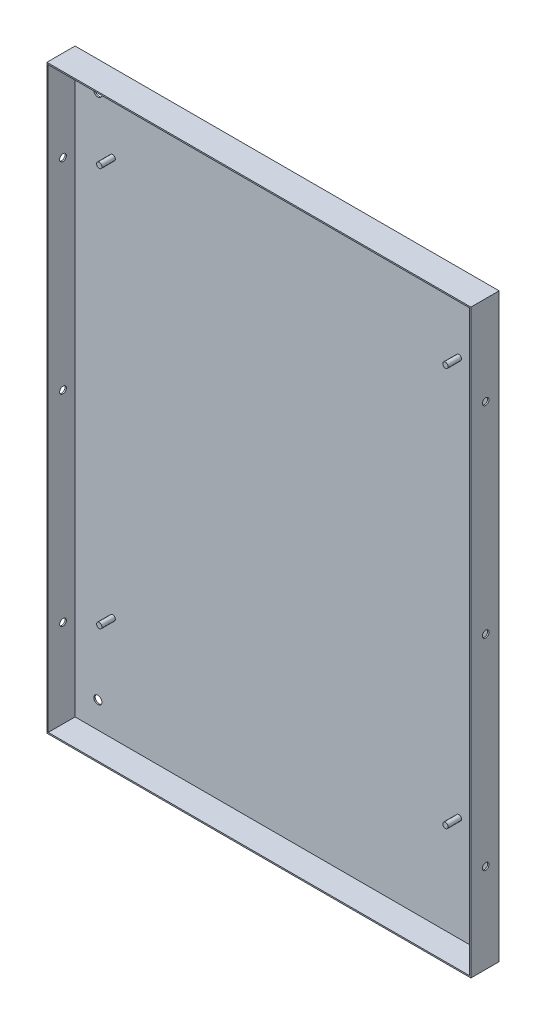
ISO-10303-21;
HEADER;
FILE_DESCRIPTION(('STEP AP214'),'2;1');
FILE_NAME('part.step','',(''),(''),'','','');
FILE_SCHEMA(('AUTOMOTIVE_DESIGN { 1 0 10303 214 1 1 1 1 }'));
ENDSEC;
DATA;
#1=APPLICATION_CONTEXT('core data for automotive mechanical design processes');
#2=APPLICATION_PROTOCOL_DEFINITION('international standard','automotive_design',2000,#1);
#3=PRODUCT_CONTEXT('',#1,'mechanical');
#4=PRODUCT('Part','Part','',(#3));
#5=PRODUCT_RELATED_PRODUCT_CATEGORY('part','',(#4));
#6=PRODUCT_DEFINITION_FORMATION('','',#4);
#7=PRODUCT_DEFINITION_CONTEXT('part definition',#1,'design');
#8=PRODUCT_DEFINITION('design','',#6,#7);
#9=PRODUCT_DEFINITION_SHAPE('','',#8);
#10=(LENGTH_UNIT() NAMED_UNIT(*) SI_UNIT(.MILLI.,.METRE.));
#11=(NAMED_UNIT(*) PLANE_ANGLE_UNIT() SI_UNIT($,.RADIAN.));
#12=(NAMED_UNIT(*) SI_UNIT($,.STERADIAN.) SOLID_ANGLE_UNIT());
#13=UNCERTAINTY_MEASURE_WITH_UNIT(LENGTH_MEASURE(1.E-05),#10,'distance_accuracy_value','');
#14=(GEOMETRIC_REPRESENTATION_CONTEXT(3) GLOBAL_UNCERTAINTY_ASSIGNED_CONTEXT((#13)) GLOBAL_UNIT_ASSIGNED_CONTEXT((#10,
#11,#12)) REPRESENTATION_CONTEXT('',''));
#15=CARTESIAN_POINT('',(0.,0.,0.));
#16=DIRECTION('',(0.,0.,1.));
#17=DIRECTION('',(1.,0.,0.));
#18=AXIS2_PLACEMENT_3D('',#15,#16,#17);
#19=CARTESIAN_POINT('',(0.,0.,1.));
#20=DIRECTION('',(-1.,0.,0.));
#21=DIRECTION('',(0.,0.,1.));
#22=AXIS2_PLACEMENT_3D('',#19,#20,#21);
#23=PLANE('',#22);
#24=CARTESIAN_POINT('',(0.,366.5,10.));
#25=DIRECTION('',(1.,0.,0.));
#26=DIRECTION('',(0.,0.,-1.));
#27=AXIS2_PLACEMENT_3D('',#24,#25,#26);
#28=CIRCLE('',#27,2.5);
#29=CARTESIAN_POINT('',(0.,366.5,7.5));
#30=VERTEX_POINT('',#29);
#31=EDGE_CURVE('E303',#30,#30,#28,.T.);
#32=ORIENTED_EDGE('',*,*,#31,.F.);
#33=EDGE_LOOP('',(#32));
#34=FACE_BOUND('',#33,.T.);
#35=CARTESIAN_POINT('',(0.,66.5,9.99999999999996));
#36=DIRECTION('',(1.,0.,0.));
#37=DIRECTION('',(0.,0.,1.));
#38=AXIS2_PLACEMENT_3D('',#35,#36,#37);
#39=CIRCLE('',#38,2.5);
#40=CARTESIAN_POINT('',(0.,66.5,12.5));
#41=VERTEX_POINT('',#40);
#42=EDGE_CURVE('E307',#41,#41,#39,.T.);
#43=ORIENTED_EDGE('',*,*,#42,.F.);
#44=EDGE_LOOP('',(#43));
#45=FACE_BOUND('',#44,.T.);
#46=CARTESIAN_POINT('',(0.,216.5,10.));
#47=DIRECTION('',(1.,0.,0.));
#48=DIRECTION('',(0.,0.,-1.));
#49=AXIS2_PLACEMENT_3D('',#46,#47,#48);
#50=CIRCLE('',#49,2.5);
#51=CARTESIAN_POINT('',(0.,216.5,7.5));
#52=VERTEX_POINT('',#51);
#53=EDGE_CURVE('E311',#52,#52,#50,.T.);
#54=ORIENTED_EDGE('',*,*,#53,.F.);
#55=EDGE_LOOP('',(#54));
#56=FACE_BOUND('',#55,.T.);
#57=DIRECTION('',(0.,1.,0.));
#58=VECTOR('',#57,1.);
#59=CARTESIAN_POINT('',(0.,0.,0.));
#60=LINE('',#59,#58);
#61=CARTESIAN_POINT('',(0.,0.,0.));
#62=VERTEX_POINT('',#61);
#63=CARTESIAN_POINT('',(0.,433.,0.));
#64=VERTEX_POINT('',#63);
#65=EDGE_CURVE('E131',#62,#64,#60,.T.);
#66=ORIENTED_EDGE('',*,*,#65,.T.);
#67=DIRECTION('',(0.,0.,-1.));
#68=VECTOR('',#67,1.);
#69=CARTESIAN_POINT('',(0.,433.,1.));
#70=LINE('',#69,#68);
#71=CARTESIAN_POINT('',(0.,433.,21.));
#72=VERTEX_POINT('',#71);
#73=EDGE_CURVE('E213',#72,#64,#70,.T.);
#74=ORIENTED_EDGE('',*,*,#73,.F.);
#75=DIRECTION('',(0.,1.,0.));
#76=VECTOR('',#75,1.);
#77=CARTESIAN_POINT('',(0.,0.,21.));
#78=LINE('',#77,#76);
#79=CARTESIAN_POINT('',(0.,0.,21.));
#80=VERTEX_POINT('',#79);
#81=EDGE_CURVE('E161',#80,#72,#78,.T.);
#82=ORIENTED_EDGE('',*,*,#81,.F.);
#83=DIRECTION('',(0.,0.,-1.));
#84=VECTOR('',#83,1.);
#85=CARTESIAN_POINT('',(0.,0.,1.));
#86=LINE('',#85,#84);
#87=EDGE_CURVE('E203',#80,#62,#86,.T.);
#88=ORIENTED_EDGE('',*,*,#87,.T.);
#89=EDGE_LOOP('',(#66,#74,#82,#88));
#90=FACE_BOUND('',#89,.T.);
#91=ADVANCED_FACE('F52',(#34,#45,#56,#90),#23,.F.);
#92=CARTESIAN_POINT('',(0.,433.,1.));
#93=DIRECTION('',(0.,-1.,0.));
#94=DIRECTION('',(1.,0.,0.));
#95=AXIS2_PLACEMENT_3D('',#92,#93,#94);
#96=PLANE('',#95);
#97=DIRECTION('',(-1.,0.,0.));
#98=VECTOR('',#97,1.);
#99=CARTESIAN_POINT('',(0.,433.,0.));
#100=LINE('',#99,#98);
#101=CARTESIAN_POINT('',(-316.,433.,0.));
#102=VERTEX_POINT('',#101);
#103=EDGE_CURVE('E195',#64,#102,#100,.T.);
#104=ORIENTED_EDGE('',*,*,#103,.T.);
#105=DIRECTION('',(0.,0.,-1.));
#106=VECTOR('',#105,1.);
#107=CARTESIAN_POINT('',(-316.,433.,1.));
#108=LINE('',#107,#106);
#109=CARTESIAN_POINT('',(-316.,433.,21.));
#110=VERTEX_POINT('',#109);
#111=EDGE_CURVE('E209',#110,#102,#108,.T.);
#112=ORIENTED_EDGE('',*,*,#111,.F.);
#113=DIRECTION('',(-1.,0.,0.));
#114=VECTOR('',#113,1.);
#115=CARTESIAN_POINT('',(0.,433.,21.));
#116=LINE('',#115,#114);
#117=EDGE_CURVE('E165',#72,#110,#116,.T.);
#118=ORIENTED_EDGE('',*,*,#117,.F.);
#119=ORIENTED_EDGE('',*,*,#73,.T.);
#120=EDGE_LOOP('',(#104,#112,#118,#119));
#121=FACE_BOUND('',#120,.T.);
#122=ADVANCED_FACE('F293',(#121),#96,.F.);
#123=CARTESIAN_POINT('',(-316.,0.,1.));
#124=DIRECTION('',(1.,0.,0.));
#125=DIRECTION('',(0.,0.,-1.));
#126=AXIS2_PLACEMENT_3D('',#123,#124,#125);
#127=PLANE('',#126);
#128=CARTESIAN_POINT('',(-316.,366.5,10.));
#129=DIRECTION('',(1.,0.,0.));
#130=DIRECTION('',(0.,0.,-1.));
#131=AXIS2_PLACEMENT_3D('',#128,#129,#130);
#132=CIRCLE('',#131,2.5);
#133=CARTESIAN_POINT('',(-316.,366.5,7.5));
#134=VERTEX_POINT('',#133);
#135=EDGE_CURVE('E224',#134,#134,#132,.F.);
#136=ORIENTED_EDGE('',*,*,#135,.F.);
#137=EDGE_LOOP('',(#136));
#138=FACE_BOUND('',#137,.T.);
#139=CARTESIAN_POINT('',(-316.,66.5,9.99999999999996));
#140=DIRECTION('',(1.,0.,0.));
#141=DIRECTION('',(0.,0.,-1.));
#142=AXIS2_PLACEMENT_3D('',#139,#140,#141);
#143=CIRCLE('',#142,2.5);
#144=CARTESIAN_POINT('',(-316.,66.5,7.49999999999996));
#145=VERTEX_POINT('',#144);
#146=EDGE_CURVE('E350',#145,#145,#143,.F.);
#147=ORIENTED_EDGE('',*,*,#146,.F.);
#148=EDGE_LOOP('',(#147));
#149=FACE_BOUND('',#148,.T.);
#150=CARTESIAN_POINT('',(-316.,216.5,10.));
#151=DIRECTION('',(1.,0.,0.));
#152=DIRECTION('',(0.,0.,-1.));
#153=AXIS2_PLACEMENT_3D('',#150,#151,#152);
#154=CIRCLE('',#153,2.5);
#155=CARTESIAN_POINT('',(-316.,216.5,7.5));
#156=VERTEX_POINT('',#155);
#157=EDGE_CURVE('E240',#156,#156,#154,.F.);
#158=ORIENTED_EDGE('',*,*,#157,.F.);
#159=EDGE_LOOP('',(#158));
#160=FACE_BOUND('',#159,.T.);
#161=DIRECTION('',(0.,-1.,0.));
#162=VECTOR('',#161,1.);
#163=CARTESIAN_POINT('',(-316.,0.,0.));
#164=LINE('',#163,#162);
#165=CARTESIAN_POINT('',(-316.,0.,0.));
#166=VERTEX_POINT('',#165);
#167=EDGE_CURVE('E198',#102,#166,#164,.T.);
#168=ORIENTED_EDGE('',*,*,#167,.T.);
#169=DIRECTION('',(0.,0.,-1.));
#170=VECTOR('',#169,1.);
#171=CARTESIAN_POINT('',(-316.,0.,1.));
#172=LINE('',#171,#170);
#173=CARTESIAN_POINT('',(-316.,0.,21.));
#174=VERTEX_POINT('',#173);
#175=EDGE_CURVE('E206',#174,#166,#172,.T.);
#176=ORIENTED_EDGE('',*,*,#175,.F.);
#177=DIRECTION('',(0.,-1.,0.));
#178=VECTOR('',#177,1.);
#179=CARTESIAN_POINT('',(-316.,0.,21.));
#180=LINE('',#179,#178);
#181=EDGE_CURVE('E169',#110,#174,#180,.T.);
#182=ORIENTED_EDGE('',*,*,#181,.F.);
#183=ORIENTED_EDGE('',*,*,#111,.T.);
#184=EDGE_LOOP('',(#168,#176,#182,#183));
#185=FACE_BOUND('',#184,.T.);
#186=ADVANCED_FACE('F298',(#138,#149,#160,#185),#127,.F.);
#187=CARTESIAN_POINT('',(0.,0.,1.));
#188=DIRECTION('',(0.,1.,0.));
#189=DIRECTION('',(0.,0.,1.));
#190=AXIS2_PLACEMENT_3D('',#187,#188,#189);
#191=PLANE('',#190);
#192=DIRECTION('',(1.,0.,0.));
#193=VECTOR('',#192,1.);
#194=CARTESIAN_POINT('',(0.,0.,0.));
#195=LINE('',#194,#193);
#196=EDGE_CURVE('E77',#166,#62,#195,.T.);
#197=ORIENTED_EDGE('',*,*,#196,.T.);
#198=ORIENTED_EDGE('',*,*,#87,.F.);
#199=DIRECTION('',(1.,0.,0.));
#200=VECTOR('',#199,1.);
#201=CARTESIAN_POINT('',(0.,0.,21.));
#202=LINE('',#201,#200);
#203=EDGE_CURVE('E157',#174,#80,#202,.T.);
#204=ORIENTED_EDGE('',*,*,#203,.F.);
#205=ORIENTED_EDGE('',*,*,#175,.T.);
#206=EDGE_LOOP('',(#197,#198,#204,#205));
#207=FACE_BOUND('',#206,.T.);
#208=ADVANCED_FACE('F321',(#207),#191,.F.);
#209=CARTESIAN_POINT('',(0.,0.,0.));
#210=DIRECTION('',(0.,0.,1.));
#211=DIRECTION('',(1.,0.,0.));
#212=AXIS2_PLACEMENT_3D('',#209,#210,#211);
#213=PLANE('',#212);
#214=CARTESIAN_POINT('',(-298.,20.5,0.));
#215=DIRECTION('',(0.,0.,1.));
#216=DIRECTION('',(1.,0.,0.));
#217=AXIS2_PLACEMENT_3D('',#214,#215,#216);
#218=CIRCLE('',#217,2.99999999999999);
#219=CARTESIAN_POINT('',(-295.,20.5,0.));
#220=VERTEX_POINT('',#219);
#221=EDGE_CURVE('E370',#220,#220,#218,.F.);
#222=ORIENTED_EDGE('',*,*,#221,.F.);
#223=EDGE_LOOP('',(#222));
#224=FACE_BOUND('',#223,.T.);
#225=CARTESIAN_POINT('',(-18.,412.5,0.));
#226=DIRECTION('',(0.,0.,1.));
#227=DIRECTION('',(1.,0.,0.));
#228=AXIS2_PLACEMENT_3D('',#225,#226,#227);
#229=CIRCLE('',#228,3.);
#230=CARTESIAN_POINT('',(-15.,412.5,0.));
#231=VERTEX_POINT('',#230);
#232=EDGE_CURVE('E438',#231,#231,#229,.F.);
#233=ORIENTED_EDGE('',*,*,#232,.F.);
#234=EDGE_LOOP('',(#233));
#235=FACE_BOUND('',#234,.T.);
#236=CARTESIAN_POINT('',(-18.,20.5,0.));
#237=DIRECTION('',(0.,0.,1.));
#238=DIRECTION('',(1.,0.,0.));
#239=AXIS2_PLACEMENT_3D('',#236,#237,#238);
#240=CIRCLE('',#239,3.);
#241=CARTESIAN_POINT('',(-15.,20.5,0.));
#242=VERTEX_POINT('',#241);
#243=EDGE_CURVE('E446',#242,#242,#240,.F.);
#244=ORIENTED_EDGE('',*,*,#243,.F.);
#245=EDGE_LOOP('',(#244));
#246=FACE_BOUND('',#245,.T.);
#247=CARTESIAN_POINT('',(-298.,412.5,0.));
#248=DIRECTION('',(0.,0.,1.));
#249=DIRECTION('',(1.,0.,0.));
#250=AXIS2_PLACEMENT_3D('',#247,#248,#249);
#251=CIRCLE('',#250,2.99999999999999);
#252=CARTESIAN_POINT('',(-295.,412.5,0.));
#253=VERTEX_POINT('',#252);
#254=EDGE_CURVE('E360',#253,#253,#251,.F.);
#255=ORIENTED_EDGE('',*,*,#254,.F.);
#256=EDGE_LOOP('',(#255));
#257=FACE_BOUND('',#256,.T.);
#258=ORIENTED_EDGE('',*,*,#65,.F.);
#259=ORIENTED_EDGE('',*,*,#196,.F.);
#260=ORIENTED_EDGE('',*,*,#167,.F.);
#261=ORIENTED_EDGE('',*,*,#103,.F.);
#262=EDGE_LOOP('',(#258,#259,#260,#261));
#263=FACE_BOUND('',#262,.T.);
#264=ADVANCED_FACE('F315',(#224,#235,#246,#257,#263),#213,.F.);
#265=CARTESIAN_POINT('',(-1.,0.,21.));
#266=DIRECTION('',(-1.,0.,0.));
#267=DIRECTION('',(0.,-1.,0.));
#268=AXIS2_PLACEMENT_3D('',#265,#266,#267);
#269=PLANE('',#268);
#270=CARTESIAN_POINT('',(-1.,366.5,10.));
#271=DIRECTION('',(-1.,0.,0.));
#272=DIRECTION('',(0.,-1.,0.));
#273=AXIS2_PLACEMENT_3D('',#270,#271,#272);
#274=CIRCLE('',#273,2.5);
#275=CARTESIAN_POINT('',(-1.,364.,10.));
#276=VERTEX_POINT('',#275);
#277=EDGE_CURVE('E243',#276,#276,#274,.T.);
#278=ORIENTED_EDGE('',*,*,#277,.F.);
#279=EDGE_LOOP('',(#278));
#280=FACE_BOUND('',#279,.T.);
#281=CARTESIAN_POINT('',(-1.,66.5,9.99999999999996));
#282=DIRECTION('',(-1.,0.,0.));
#283=DIRECTION('',(0.,-1.,0.));
#284=AXIS2_PLACEMENT_3D('',#281,#282,#283);
#285=CIRCLE('',#284,2.5);
#286=CARTESIAN_POINT('',(-1.,64.,9.99999999999996));
#287=VERTEX_POINT('',#286);
#288=EDGE_CURVE('E228',#287,#287,#285,.T.);
#289=ORIENTED_EDGE('',*,*,#288,.F.);
#290=EDGE_LOOP('',(#289));
#291=FACE_BOUND('',#290,.T.);
#292=CARTESIAN_POINT('',(-1.,216.5,10.));
#293=DIRECTION('',(-1.,0.,0.));
#294=DIRECTION('',(0.,-1.,0.));
#295=AXIS2_PLACEMENT_3D('',#292,#293,#294);
#296=CIRCLE('',#295,2.5);
#297=CARTESIAN_POINT('',(-1.,214.,10.));
#298=VERTEX_POINT('',#297);
#299=EDGE_CURVE('E223',#298,#298,#296,.T.);
#300=ORIENTED_EDGE('',*,*,#299,.F.);
#301=EDGE_LOOP('',(#300));
#302=FACE_BOUND('',#301,.T.);
#303=DIRECTION('',(0.,1.,0.));
#304=VECTOR('',#303,1.);
#305=CARTESIAN_POINT('',(-1.,0.,1.));
#306=LINE('',#305,#304);
#307=CARTESIAN_POINT('',(-1.,1.,1.));
#308=VERTEX_POINT('',#307);
#309=CARTESIAN_POINT('',(-0.999999999999999,432.,1.));
#310=VERTEX_POINT('',#309);
#311=EDGE_CURVE('E125',#308,#310,#306,.T.);
#312=ORIENTED_EDGE('',*,*,#311,.F.);
#313=DIRECTION('',(0.,0.,-1.));
#314=VECTOR('',#313,1.);
#315=CARTESIAN_POINT('',(-1.,1.,21.));
#316=LINE('',#315,#314);
#317=CARTESIAN_POINT('',(-1.,1.,21.));
#318=VERTEX_POINT('',#317);
#319=EDGE_CURVE('E120',#318,#308,#316,.T.);
#320=ORIENTED_EDGE('',*,*,#319,.F.);
#321=DIRECTION('',(0.,1.,0.));
#322=VECTOR('',#321,1.);
#323=CARTESIAN_POINT('',(-1.,0.,21.));
#324=LINE('',#323,#322);
#325=CARTESIAN_POINT('',(-0.999999999999999,432.,21.));
#326=VERTEX_POINT('',#325);
#327=EDGE_CURVE('E123',#318,#326,#324,.T.);
#328=ORIENTED_EDGE('',*,*,#327,.T.);
#329=DIRECTION('',(0.,0.,-1.));
#330=VECTOR('',#329,1.);
#331=CARTESIAN_POINT('',(-0.999999999999999,432.,21.));
#332=LINE('',#331,#330);
#333=EDGE_CURVE('E173',#326,#310,#332,.T.);
#334=ORIENTED_EDGE('',*,*,#333,.T.);
#335=EDGE_LOOP('',(#312,#320,#328,#334));
#336=FACE_BOUND('',#335,.T.);
#337=ADVANCED_FACE('F122',(#280,#291,#302,#336),#269,.T.);
#338=CARTESIAN_POINT('',(0.,1.,21.));
#339=DIRECTION('',(0.,1.,0.));
#340=DIRECTION('',(0.,0.,1.));
#341=AXIS2_PLACEMENT_3D('',#338,#339,#340);
#342=PLANE('',#341);
#343=DIRECTION('',(1.,0.,0.));
#344=VECTOR('',#343,1.);
#345=CARTESIAN_POINT('',(0.,1.,1.));
#346=LINE('',#345,#344);
#347=CARTESIAN_POINT('',(-315.,1.,1.));
#348=VERTEX_POINT('',#347);
#349=EDGE_CURVE('E176',#348,#308,#346,.T.);
#350=ORIENTED_EDGE('',*,*,#349,.F.);
#351=DIRECTION('',(0.,0.,-1.));
#352=VECTOR('',#351,1.);
#353=CARTESIAN_POINT('',(-315.,1.,21.));
#354=LINE('',#353,#352);
#355=CARTESIAN_POINT('',(-315.,1.,21.));
#356=VERTEX_POINT('',#355);
#357=EDGE_CURVE('E132',#356,#348,#354,.T.);
#358=ORIENTED_EDGE('',*,*,#357,.F.);
#359=DIRECTION('',(1.,0.,0.));
#360=VECTOR('',#359,1.);
#361=CARTESIAN_POINT('',(0.,1.,21.));
#362=LINE('',#361,#360);
#363=EDGE_CURVE('E139',#356,#318,#362,.T.);
#364=ORIENTED_EDGE('',*,*,#363,.T.);
#365=ORIENTED_EDGE('',*,*,#319,.T.);
#366=EDGE_LOOP('',(#350,#358,#364,#365));
#367=FACE_BOUND('',#366,.T.);
#368=ADVANCED_FACE('F147',(#367),#342,.T.);
#369=CARTESIAN_POINT('',(-315.,0.,21.));
#370=DIRECTION('',(1.,0.,0.));
#371=DIRECTION('',(0.,1.,0.));
#372=AXIS2_PLACEMENT_3D('',#369,#370,#371);
#373=PLANE('',#372);
#374=CARTESIAN_POINT('',(-315.,366.5,10.));
#375=DIRECTION('',(1.,0.,0.));
#376=DIRECTION('',(0.,1.,0.));
#377=AXIS2_PLACEMENT_3D('',#374,#375,#376);
#378=CIRCLE('',#377,2.5);
#379=CARTESIAN_POINT('',(-315.,369.,10.));
#380=VERTEX_POINT('',#379);
#381=EDGE_CURVE('E55',#380,#380,#378,.T.);
#382=ORIENTED_EDGE('',*,*,#381,.F.);
#383=EDGE_LOOP('',(#382));
#384=FACE_BOUND('',#383,.T.);
#385=CARTESIAN_POINT('',(-315.,66.5,9.99999999999996));
#386=DIRECTION('',(1.,0.,0.));
#387=DIRECTION('',(0.,1.,0.));
#388=AXIS2_PLACEMENT_3D('',#385,#386,#387);
#389=CIRCLE('',#388,2.5);
#390=CARTESIAN_POINT('',(-315.,69.,9.99999999999996));
#391=VERTEX_POINT('',#390);
#392=EDGE_CURVE('E225',#391,#391,#389,.T.);
#393=ORIENTED_EDGE('',*,*,#392,.F.);
#394=EDGE_LOOP('',(#393));
#395=FACE_BOUND('',#394,.T.);
#396=CARTESIAN_POINT('',(-315.,216.5,10.));
#397=DIRECTION('',(1.,0.,0.));
#398=DIRECTION('',(0.,1.,0.));
#399=AXIS2_PLACEMENT_3D('',#396,#397,#398);
#400=CIRCLE('',#399,2.5);
#401=CARTESIAN_POINT('',(-315.,219.,10.));
#402=VERTEX_POINT('',#401);
#403=EDGE_CURVE('E220',#402,#402,#400,.T.);
#404=ORIENTED_EDGE('',*,*,#403,.F.);
#405=EDGE_LOOP('',(#404));
#406=FACE_BOUND('',#405,.T.);
#407=DIRECTION('',(0.,-1.,0.));
#408=VECTOR('',#407,1.);
#409=CARTESIAN_POINT('',(-315.,0.,1.));
#410=LINE('',#409,#408);
#411=CARTESIAN_POINT('',(-315.,432.,1.));
#412=VERTEX_POINT('',#411);
#413=EDGE_CURVE('E69',#412,#348,#410,.T.);
#414=ORIENTED_EDGE('',*,*,#413,.F.);
#415=DIRECTION('',(0.,0.,-1.));
#416=VECTOR('',#415,1.);
#417=CARTESIAN_POINT('',(-315.,432.,21.));
#418=LINE('',#417,#416);
#419=CARTESIAN_POINT('',(-315.,432.,21.));
#420=VERTEX_POINT('',#419);
#421=EDGE_CURVE('E187',#420,#412,#418,.T.);
#422=ORIENTED_EDGE('',*,*,#421,.F.);
#423=DIRECTION('',(0.,-1.,0.));
#424=VECTOR('',#423,1.);
#425=CARTESIAN_POINT('',(-315.,0.,21.));
#426=LINE('',#425,#424);
#427=EDGE_CURVE('E149',#420,#356,#426,.T.);
#428=ORIENTED_EDGE('',*,*,#427,.T.);
#429=ORIENTED_EDGE('',*,*,#357,.T.);
#430=EDGE_LOOP('',(#414,#422,#428,#429));
#431=FACE_BOUND('',#430,.T.);
#432=ADVANCED_FACE('F280',(#384,#395,#406,#431),#373,.T.);
#433=CARTESIAN_POINT('',(0.,432.,21.));
#434=DIRECTION('',(0.,1.,0.));
#435=DIRECTION('',(0.,0.,1.));
#436=AXIS2_PLACEMENT_3D('',#433,#434,#435);
#437=PLANE('',#436);
#438=DIRECTION('',(1.,0.,0.));
#439=VECTOR('',#438,1.);
#440=CARTESIAN_POINT('',(0.,432.,1.));
#441=LINE('',#440,#439);
#442=EDGE_CURVE('E145',#412,#310,#441,.T.);
#443=ORIENTED_EDGE('',*,*,#442,.T.);
#444=ORIENTED_EDGE('',*,*,#333,.F.);
#445=DIRECTION('',(1.,0.,0.));
#446=VECTOR('',#445,1.);
#447=CARTESIAN_POINT('',(0.,432.,21.));
#448=LINE('',#447,#446);
#449=EDGE_CURVE('E142',#420,#326,#448,.T.);
#450=ORIENTED_EDGE('',*,*,#449,.F.);
#451=ORIENTED_EDGE('',*,*,#421,.T.);
#452=EDGE_LOOP('',(#443,#444,#450,#451));
#453=FACE_BOUND('',#452,.T.);
#454=ADVANCED_FACE('F279',(#453),#437,.F.);
#455=CARTESIAN_POINT('',(0.,0.,21.));
#456=DIRECTION('',(0.,0.,1.));
#457=DIRECTION('',(1.,0.,0.));
#458=AXIS2_PLACEMENT_3D('',#455,#456,#457);
#459=PLANE('',#458);
#460=ORIENTED_EDGE('',*,*,#327,.F.);
#461=ORIENTED_EDGE('',*,*,#363,.F.);
#462=ORIENTED_EDGE('',*,*,#427,.F.);
#463=ORIENTED_EDGE('',*,*,#449,.T.);
#464=EDGE_LOOP('',(#460,#461,#462,#463));
#465=FACE_BOUND('',#464,.T.);
#466=ORIENTED_EDGE('',*,*,#203,.T.);
#467=ORIENTED_EDGE('',*,*,#81,.T.);
#468=ORIENTED_EDGE('',*,*,#117,.T.);
#469=ORIENTED_EDGE('',*,*,#181,.T.);
#470=EDGE_LOOP('',(#466,#467,#468,#469));
#471=FACE_BOUND('',#470,.T.);
#472=ADVANCED_FACE('F136',(#465,#471),#459,.T.);
#473=CARTESIAN_POINT('',(0.,0.,1.));
#474=DIRECTION('',(0.,0.,1.));
#475=DIRECTION('',(1.,0.,0.));
#476=AXIS2_PLACEMENT_3D('',#473,#474,#475);
#477=PLANE('',#476);
#478=CARTESIAN_POINT('',(-298.,20.5,1.));
#479=DIRECTION('',(0.,0.,1.));
#480=DIRECTION('',(-1.,0.,0.));
#481=AXIS2_PLACEMENT_3D('',#478,#479,#480);
#482=CIRCLE('',#481,2.99999999999999);
#483=CARTESIAN_POINT('',(-301.,20.5,1.));
#484=VERTEX_POINT('',#483);
#485=EDGE_CURVE('E436',#484,#484,#482,.T.);
#486=ORIENTED_EDGE('',*,*,#485,.F.);
#487=EDGE_LOOP('',(#486));
#488=FACE_BOUND('',#487,.T.);
#489=CARTESIAN_POINT('',(-18.,412.5,1.));
#490=DIRECTION('',(0.,0.,1.));
#491=DIRECTION('',(-1.,0.,0.));
#492=AXIS2_PLACEMENT_3D('',#489,#490,#491);
#493=CIRCLE('',#492,3.);
#494=CARTESIAN_POINT('',(-21.,412.5,1.));
#495=VERTEX_POINT('',#494);
#496=EDGE_CURVE('E444',#495,#495,#493,.T.);
#497=ORIENTED_EDGE('',*,*,#496,.F.);
#498=EDGE_LOOP('',(#497));
#499=FACE_BOUND('',#498,.T.);
#500=CARTESIAN_POINT('',(-18.,20.5,1.));
#501=DIRECTION('',(0.,0.,1.));
#502=DIRECTION('',(1.,0.,0.));
#503=AXIS2_PLACEMENT_3D('',#500,#501,#502);
#504=CIRCLE('',#503,3.);
#505=CARTESIAN_POINT('',(-15.,20.5,1.));
#506=VERTEX_POINT('',#505);
#507=EDGE_CURVE('E455',#506,#506,#504,.T.);
#508=ORIENTED_EDGE('',*,*,#507,.F.);
#509=EDGE_LOOP('',(#508));
#510=FACE_BOUND('',#509,.T.);
#511=CARTESIAN_POINT('',(-298.,412.5,1.));
#512=DIRECTION('',(0.,0.,1.));
#513=DIRECTION('',(1.,0.,0.));
#514=AXIS2_PLACEMENT_3D('',#511,#512,#513);
#515=CIRCLE('',#514,2.99999999999999);
#516=CARTESIAN_POINT('',(-295.,412.5,1.));
#517=VERTEX_POINT('',#516);
#518=EDGE_CURVE('E364',#517,#517,#515,.T.);
#519=ORIENTED_EDGE('',*,*,#518,.F.);
#520=EDGE_LOOP('',(#519));
#521=FACE_BOUND('',#520,.T.);
#522=CARTESIAN_POINT('',(-29.0000000000001,79.,1.));
#523=DIRECTION('',(0.,0.,1.));
#524=DIRECTION('',(1.,0.,0.));
#525=AXIS2_PLACEMENT_3D('',#522,#523,#524);
#526=CIRCLE('',#525,2.);
#527=CARTESIAN_POINT('',(-27.0000000000001,79.,1.));
#528=VERTEX_POINT('',#527);
#529=EDGE_CURVE('E13',#528,#528,#526,.T.);
#530=ORIENTED_EDGE('',*,*,#529,.F.);
#531=EDGE_LOOP('',(#530));
#532=FACE_BOUND('',#531,.T.);
#533=CARTESIAN_POINT('',(-287.,79.,1.));
#534=DIRECTION('',(0.,0.,1.));
#535=DIRECTION('',(1.,0.,0.));
#536=AXIS2_PLACEMENT_3D('',#533,#534,#535);
#537=CIRCLE('',#536,2.);
#538=CARTESIAN_POINT('',(-285.,79.,1.));
#539=VERTEX_POINT('',#538);
#540=EDGE_CURVE('E252',#539,#539,#537,.T.);
#541=ORIENTED_EDGE('',*,*,#540,.F.);
#542=EDGE_LOOP('',(#541));
#543=FACE_BOUND('',#542,.T.);
#544=CARTESIAN_POINT('',(-29.,376.,1.));
#545=DIRECTION('',(0.,0.,1.));
#546=DIRECTION('',(1.,0.,0.));
#547=AXIS2_PLACEMENT_3D('',#544,#545,#546);
#548=CIRCLE('',#547,2.);
#549=CARTESIAN_POINT('',(-27.,376.,1.));
#550=VERTEX_POINT('',#549);
#551=EDGE_CURVE('E61',#550,#550,#548,.T.);
#552=ORIENTED_EDGE('',*,*,#551,.F.);
#553=EDGE_LOOP('',(#552));
#554=FACE_BOUND('',#553,.T.);
#555=CARTESIAN_POINT('',(-287.,376.,1.));
#556=DIRECTION('',(0.,0.,1.));
#557=DIRECTION('',(1.,0.,0.));
#558=AXIS2_PLACEMENT_3D('',#555,#556,#557);
#559=CIRCLE('',#558,2.);
#560=CARTESIAN_POINT('',(-285.,376.,1.));
#561=VERTEX_POINT('',#560);
#562=EDGE_CURVE('E263',#561,#561,#559,.T.);
#563=ORIENTED_EDGE('',*,*,#562,.F.);
#564=EDGE_LOOP('',(#563));
#565=FACE_BOUND('',#564,.T.);
#566=ORIENTED_EDGE('',*,*,#311,.T.);
#567=ORIENTED_EDGE('',*,*,#442,.F.);
#568=ORIENTED_EDGE('',*,*,#413,.T.);
#569=ORIENTED_EDGE('',*,*,#349,.T.);
#570=EDGE_LOOP('',(#566,#567,#568,#569));
#571=FACE_BOUND('',#570,.T.);
#572=ADVANCED_FACE('F272',(#488,#499,#510,#521,#532,#543,#554,#565,#571),#477,.T.);
#573=CARTESIAN_POINT('',(-287.,376.,11.));
#574=DIRECTION('',(0.,0.,-1.));
#575=DIRECTION('',(-1.,0.,0.));
#576=AXIS2_PLACEMENT_3D('',#573,#574,#575);
#577=CYLINDRICAL_SURFACE('',#576,2.);
#578=CARTESIAN_POINT('',(-287.,376.,11.));
#579=DIRECTION('',(0.,0.,1.));
#580=DIRECTION('',(1.,0.,0.));
#581=AXIS2_PLACEMENT_3D('',#578,#579,#580);
#582=CIRCLE('',#581,2.);
#583=CARTESIAN_POINT('',(-285.,376.,11.));
#584=VERTEX_POINT('',#583);
#585=EDGE_CURVE('E177',#584,#584,#582,.T.);
#586=ORIENTED_EDGE('',*,*,#585,.F.);
#587=EDGE_LOOP('',(#586));
#588=FACE_BOUND('',#587,.T.);
#589=ORIENTED_EDGE('',*,*,#562,.T.);
#590=EDGE_LOOP('',(#589));
#591=FACE_BOUND('',#590,.T.);
#592=ADVANCED_FACE('F270',(#588,#591),#577,.T.);
#593=CARTESIAN_POINT('',(-287.,376.,11.));
#594=DIRECTION('',(0.,0.,1.));
#595=DIRECTION('',(1.,0.,0.));
#596=AXIS2_PLACEMENT_3D('',#593,#594,#595);
#597=PLANE('',#596);
#598=ORIENTED_EDGE('',*,*,#585,.T.);
#599=EDGE_LOOP('',(#598));
#600=FACE_BOUND('',#599,.T.);
#601=ADVANCED_FACE('F474',(#600),#597,.T.);
#602=CARTESIAN_POINT('',(-29.,376.,11.));
#603=DIRECTION('',(0.,0.,-1.));
#604=DIRECTION('',(-1.,0.,0.));
#605=AXIS2_PLACEMENT_3D('',#602,#603,#604);
#606=CYLINDRICAL_SURFACE('',#605,2.);
#607=CARTESIAN_POINT('',(-29.,376.,11.));
#608=DIRECTION('',(0.,0.,-1.));
#609=DIRECTION('',(-1.,0.,0.));
#610=AXIS2_PLACEMENT_3D('',#607,#608,#609);
#611=CIRCLE('',#610,2.);
#612=CARTESIAN_POINT('',(-31.,376.,11.));
#613=VERTEX_POINT('',#612);
#614=EDGE_CURVE('E256',#613,#613,#611,.T.);
#615=ORIENTED_EDGE('',*,*,#614,.T.);
#616=EDGE_LOOP('',(#615));
#617=FACE_BOUND('',#616,.T.);
#618=ORIENTED_EDGE('',*,*,#551,.T.);
#619=EDGE_LOOP('',(#618));
#620=FACE_BOUND('',#619,.T.);
#621=ADVANCED_FACE('F471',(#617,#620),#606,.T.);
#622=CARTESIAN_POINT('',(-29.,376.,11.));
#623=DIRECTION('',(0.,0.,-1.));
#624=DIRECTION('',(-1.,0.,0.));
#625=AXIS2_PLACEMENT_3D('',#622,#623,#624);
#626=PLANE('',#625);
#627=ORIENTED_EDGE('',*,*,#614,.F.);
#628=EDGE_LOOP('',(#627));
#629=FACE_BOUND('',#628,.T.);
#630=ADVANCED_FACE('F473',(#629),#626,.F.);
#631=CARTESIAN_POINT('',(-287.,79.,11.));
#632=DIRECTION('',(0.,0.,-1.));
#633=DIRECTION('',(-1.,0.,0.));
#634=AXIS2_PLACEMENT_3D('',#631,#632,#633);
#635=CYLINDRICAL_SURFACE('',#634,2.);
#636=CARTESIAN_POINT('',(-287.,79.,11.));
#637=DIRECTION('',(0.,0.,1.));
#638=DIRECTION('',(1.,0.,0.));
#639=AXIS2_PLACEMENT_3D('',#636,#637,#638);
#640=CIRCLE('',#639,2.);
#641=CARTESIAN_POINT('',(-285.,79.,11.));
#642=VERTEX_POINT('',#641);
#643=EDGE_CURVE('E251',#642,#642,#640,.T.);
#644=ORIENTED_EDGE('',*,*,#643,.F.);
#645=EDGE_LOOP('',(#644));
#646=FACE_BOUND('',#645,.T.);
#647=ORIENTED_EDGE('',*,*,#540,.T.);
#648=EDGE_LOOP('',(#647));
#649=FACE_BOUND('',#648,.T.);
#650=ADVANCED_FACE('F481',(#646,#649),#635,.T.);
#651=CARTESIAN_POINT('',(-287.,79.,11.));
#652=DIRECTION('',(0.,0.,1.));
#653=DIRECTION('',(1.,0.,0.));
#654=AXIS2_PLACEMENT_3D('',#651,#652,#653);
#655=PLANE('',#654);
#656=ORIENTED_EDGE('',*,*,#643,.T.);
#657=EDGE_LOOP('',(#656));
#658=FACE_BOUND('',#657,.T.);
#659=ADVANCED_FACE('F487',(#658),#655,.T.);
#660=CARTESIAN_POINT('',(-29.0000000000001,79.,11.));
#661=DIRECTION('',(0.,0.,-1.));
#662=DIRECTION('',(-1.,0.,0.));
#663=AXIS2_PLACEMENT_3D('',#660,#661,#662);
#664=CYLINDRICAL_SURFACE('',#663,2.);
#665=CARTESIAN_POINT('',(-29.0000000000001,79.,11.));
#666=DIRECTION('',(0.,0.,-1.));
#667=DIRECTION('',(-1.,0.,0.));
#668=AXIS2_PLACEMENT_3D('',#665,#666,#667);
#669=CIRCLE('',#668,2.);
#670=CARTESIAN_POINT('',(-31.0000000000001,79.,11.));
#671=VERTEX_POINT('',#670);
#672=EDGE_CURVE('E247',#671,#671,#669,.T.);
#673=ORIENTED_EDGE('',*,*,#672,.T.);
#674=EDGE_LOOP('',(#673));
#675=FACE_BOUND('',#674,.T.);
#676=ORIENTED_EDGE('',*,*,#529,.T.);
#677=EDGE_LOOP('',(#676));
#678=FACE_BOUND('',#677,.T.);
#679=ADVANCED_FACE('F394',(#675,#678),#664,.T.);
#680=CARTESIAN_POINT('',(-29.0000000000001,79.,11.));
#681=DIRECTION('',(0.,0.,-1.));
#682=DIRECTION('',(-1.,0.,0.));
#683=AXIS2_PLACEMENT_3D('',#680,#681,#682);
#684=PLANE('',#683);
#685=ORIENTED_EDGE('',*,*,#672,.F.);
#686=EDGE_LOOP('',(#685));
#687=FACE_BOUND('',#686,.T.);
#688=ADVANCED_FACE('F387',(#687),#684,.F.);
#689=CARTESIAN_POINT('',(-323.071067811866,216.5,10.));
#690=DIRECTION('',(1.,0.,0.));
#691=DIRECTION('',(0.,0.,-1.));
#692=AXIS2_PLACEMENT_3D('',#689,#690,#691);
#693=CYLINDRICAL_SURFACE('',#692,2.5);
#694=ORIENTED_EDGE('',*,*,#403,.T.);
#695=EDGE_LOOP('',(#694));
#696=FACE_BOUND('',#695,.T.);
#697=ORIENTED_EDGE('',*,*,#157,.T.);
#698=EDGE_LOOP('',(#697));
#699=FACE_BOUND('',#698,.T.);
#700=ADVANCED_FACE('F385',(#696,#699),#693,.F.);
#701=CARTESIAN_POINT('',(-323.071067811866,66.5,9.99999999999996));
#702=DIRECTION('',(1.,0.,0.));
#703=DIRECTION('',(0.,0.,-1.));
#704=AXIS2_PLACEMENT_3D('',#701,#702,#703);
#705=CYLINDRICAL_SURFACE('',#704,2.5);
#706=ORIENTED_EDGE('',*,*,#392,.T.);
#707=EDGE_LOOP('',(#706));
#708=FACE_BOUND('',#707,.T.);
#709=ORIENTED_EDGE('',*,*,#146,.T.);
#710=EDGE_LOOP('',(#709));
#711=FACE_BOUND('',#710,.T.);
#712=ADVANCED_FACE('F348',(#708,#711),#705,.F.);
#713=CARTESIAN_POINT('',(-323.071067811866,366.5,10.));
#714=DIRECTION('',(1.,0.,0.));
#715=DIRECTION('',(0.,0.,-1.));
#716=AXIS2_PLACEMENT_3D('',#713,#714,#715);
#717=CYLINDRICAL_SURFACE('',#716,2.5);
#718=ORIENTED_EDGE('',*,*,#381,.T.);
#719=EDGE_LOOP('',(#718));
#720=FACE_BOUND('',#719,.T.);
#721=ORIENTED_EDGE('',*,*,#135,.T.);
#722=EDGE_LOOP('',(#721));
#723=FACE_BOUND('',#722,.T.);
#724=ADVANCED_FACE('F379',(#720,#723),#717,.F.);
#725=ORIENTED_EDGE('',*,*,#299,.T.);
#726=EDGE_LOOP('',(#725));
#727=FACE_BOUND('',#726,.T.);
#728=ORIENTED_EDGE('',*,*,#53,.T.);
#729=EDGE_LOOP('',(#728));
#730=FACE_BOUND('',#729,.T.);
#731=ADVANCED_FACE('F346',(#727,#730),#693,.F.);
#732=ORIENTED_EDGE('',*,*,#288,.T.);
#733=EDGE_LOOP('',(#732));
#734=FACE_BOUND('',#733,.T.);
#735=ORIENTED_EDGE('',*,*,#42,.T.);
#736=EDGE_LOOP('',(#735));
#737=FACE_BOUND('',#736,.T.);
#738=ADVANCED_FACE('F342',(#734,#737),#705,.F.);
#739=ORIENTED_EDGE('',*,*,#277,.T.);
#740=EDGE_LOOP('',(#739));
#741=FACE_BOUND('',#740,.T.);
#742=ORIENTED_EDGE('',*,*,#31,.T.);
#743=EDGE_LOOP('',(#742));
#744=FACE_BOUND('',#743,.T.);
#745=ADVANCED_FACE('F345',(#741,#744),#717,.F.);
#746=CARTESIAN_POINT('',(-298.,412.5,-8.48528137423858));
#747=DIRECTION('',(0.,0.,1.));
#748=DIRECTION('',(1.,0.,0.));
#749=AXIS2_PLACEMENT_3D('',#746,#747,#748);
#750=CYLINDRICAL_SURFACE('',#749,2.99999999999999);
#751=ORIENTED_EDGE('',*,*,#254,.T.);
#752=EDGE_LOOP('',(#751));
#753=FACE_BOUND('',#752,.T.);
#754=ORIENTED_EDGE('',*,*,#518,.T.);
#755=EDGE_LOOP('',(#754));
#756=FACE_BOUND('',#755,.T.);
#757=ADVANCED_FACE('F409',(#753,#756),#750,.F.);
#758=CARTESIAN_POINT('',(-18.,20.5,-8.48528137423858));
#759=DIRECTION('',(0.,0.,1.));
#760=DIRECTION('',(1.,0.,0.));
#761=AXIS2_PLACEMENT_3D('',#758,#759,#760);
#762=CYLINDRICAL_SURFACE('',#761,3.);
#763=ORIENTED_EDGE('',*,*,#243,.T.);
#764=EDGE_LOOP('',(#763));
#765=FACE_BOUND('',#764,.T.);
#766=ORIENTED_EDGE('',*,*,#507,.T.);
#767=EDGE_LOOP('',(#766));
#768=FACE_BOUND('',#767,.T.);
#769=ADVANCED_FACE('F414',(#765,#768),#762,.F.);
#770=CARTESIAN_POINT('',(-18.,412.5,-8.48528137423858));
#771=DIRECTION('',(0.,0.,1.));
#772=DIRECTION('',(1.,0.,0.));
#773=AXIS2_PLACEMENT_3D('',#770,#771,#772);
#774=CYLINDRICAL_SURFACE('',#773,3.);
#775=ORIENTED_EDGE('',*,*,#232,.T.);
#776=EDGE_LOOP('',(#775));
#777=FACE_BOUND('',#776,.T.);
#778=ORIENTED_EDGE('',*,*,#496,.T.);
#779=EDGE_LOOP('',(#778));
#780=FACE_BOUND('',#779,.T.);
#781=ADVANCED_FACE('F418',(#777,#780),#774,.F.);
#782=CARTESIAN_POINT('',(-298.,20.5,-8.48528137423858));
#783=DIRECTION('',(0.,0.,1.));
#784=DIRECTION('',(1.,0.,0.));
#785=AXIS2_PLACEMENT_3D('',#782,#783,#784);
#786=CYLINDRICAL_SURFACE('',#785,2.99999999999999);
#787=ORIENTED_EDGE('',*,*,#221,.T.);
#788=EDGE_LOOP('',(#787));
#789=FACE_BOUND('',#788,.T.);
#790=ORIENTED_EDGE('',*,*,#485,.T.);
#791=EDGE_LOOP('',(#790));
#792=FACE_BOUND('',#791,.T.);
#793=ADVANCED_FACE('F425',(#789,#792),#786,.F.);
#794=CLOSED_SHELL('',(#91,#122,#186,#208,#264,#337,#368,#432,#454,#472,#572,#592,#601,#621,#630,
#650,#659,#679,#688,#700,#712,#724,#731,#738,#745,#757,#769,#781,#793));
#795=MANIFOLD_SOLID_BREP('B2',#794);
#796=ADVANCED_BREP_SHAPE_REPRESENTATION('',(#18,#795),#14);
#797=SHAPE_DEFINITION_REPRESENTATION(#9,#796);
ENDSEC;
END-ISO-10303-21;
